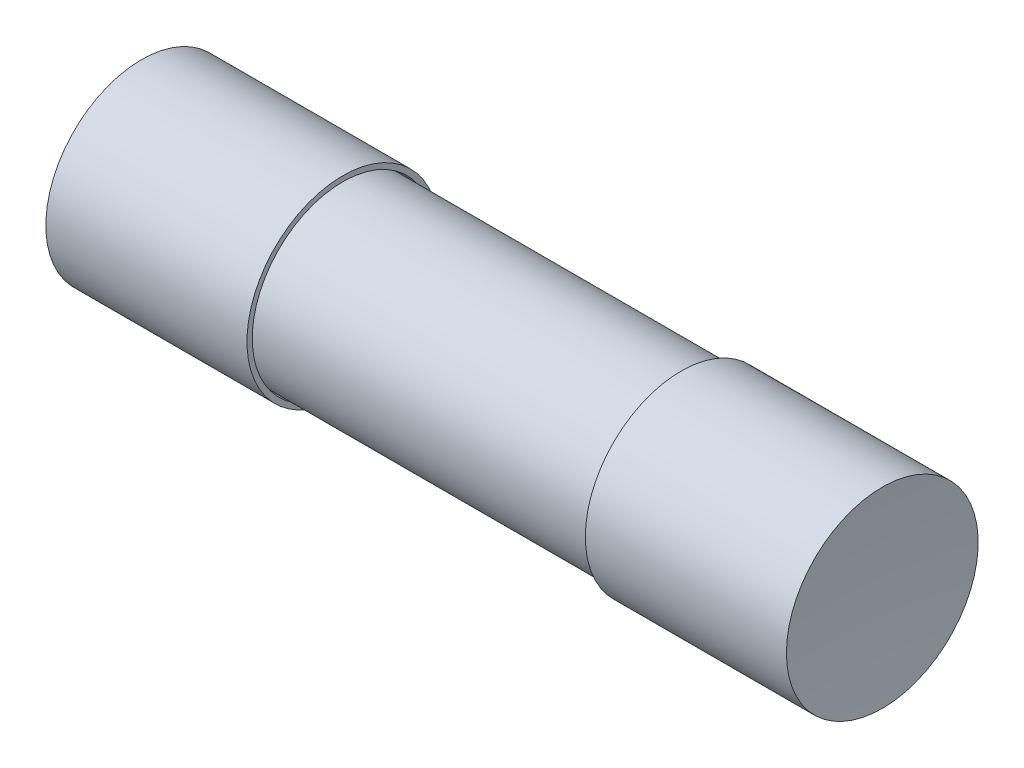
ISO-10303-21;
HEADER;
FILE_DESCRIPTION(('STEP AP214'),'2;1');
FILE_NAME('part.step','',(''),(''),'','','');
FILE_SCHEMA(('AUTOMOTIVE_DESIGN { 1 0 10303 214 1 1 1 1 }'));
ENDSEC;
DATA;
#1=APPLICATION_CONTEXT('core data for automotive mechanical design processes');
#2=APPLICATION_PROTOCOL_DEFINITION('international standard','automotive_design',2000,#1);
#3=PRODUCT_CONTEXT('',#1,'mechanical');
#4=PRODUCT('Part','Part','',(#3));
#5=PRODUCT_RELATED_PRODUCT_CATEGORY('part','',(#4));
#6=PRODUCT_DEFINITION_FORMATION('','',#4);
#7=PRODUCT_DEFINITION_CONTEXT('part definition',#1,'design');
#8=PRODUCT_DEFINITION('design','',#6,#7);
#9=PRODUCT_DEFINITION_SHAPE('','',#8);
#10=(LENGTH_UNIT() NAMED_UNIT(*) SI_UNIT(.MILLI.,.METRE.));
#11=(NAMED_UNIT(*) PLANE_ANGLE_UNIT() SI_UNIT($,.RADIAN.));
#12=(NAMED_UNIT(*) SI_UNIT($,.STERADIAN.) SOLID_ANGLE_UNIT());
#13=UNCERTAINTY_MEASURE_WITH_UNIT(LENGTH_MEASURE(1.E-05),#10,'distance_accuracy_value','');
#14=(GEOMETRIC_REPRESENTATION_CONTEXT(3) GLOBAL_UNCERTAINTY_ASSIGNED_CONTEXT((#13)) GLOBAL_UNIT_ASSIGNED_CONTEXT((#10,
#11,#12)) REPRESENTATION_CONTEXT('',''));
#15=CARTESIAN_POINT('',(0.,0.,0.));
#16=DIRECTION('',(0.,0.,1.));
#17=DIRECTION('',(1.,0.,0.));
#18=AXIS2_PLACEMENT_3D('',#15,#16,#17);
#19=CARTESIAN_POINT('',(-9.75,0.,0.));
#20=DIRECTION('',(1.,0.,0.));
#21=DIRECTION('',(0.,0.,-1.));
#22=AXIS2_PLACEMENT_3D('',#19,#20,#21);
#23=CYLINDRICAL_SURFACE('',#22,2.375);
#24=CARTESIAN_POINT('',(-9.75,0.,0.));
#25=DIRECTION('',(1.,0.,0.));
#26=DIRECTION('',(0.,0.,-1.));
#27=AXIS2_PLACEMENT_3D('',#24,#25,#26);
#28=CIRCLE('',#27,2.375);
#29=CARTESIAN_POINT('',(-9.75,0.,-2.375));
#30=VERTEX_POINT('',#29);
#31=EDGE_CURVE('P0_E18',#30,#30,#28,.T.);
#32=ORIENTED_EDGE('',*,*,#31,.T.);
#33=EDGE_LOOP('',(#32));
#34=FACE_BOUND('',#33,.T.);
#35=CARTESIAN_POINT('',(9.75,0.,0.));
#36=DIRECTION('',(1.,0.,0.));
#37=DIRECTION('',(0.,0.,-1.));
#38=AXIS2_PLACEMENT_3D('',#35,#36,#37);
#39=CIRCLE('',#38,2.375);
#40=CARTESIAN_POINT('',(9.75,0.,-2.375));
#41=VERTEX_POINT('',#40);
#42=EDGE_CURVE('P0_E27',#41,#41,#39,.T.);
#43=ORIENTED_EDGE('',*,*,#42,.F.);
#44=EDGE_LOOP('',(#43));
#45=FACE_BOUND('',#44,.T.);
#46=ADVANCED_FACE('P0_F14',(#34,#45),#23,.T.);
#47=CARTESIAN_POINT('',(-9.75,-2.4035,2.4035));
#48=DIRECTION('',(1.,0.,0.));
#49=DIRECTION('',(0.,0.,-1.));
#50=AXIS2_PLACEMENT_3D('',#47,#48,#49);
#51=PLANE('',#50);
#52=CARTESIAN_POINT('',(-9.75,0.,0.));
#53=DIRECTION('',(1.,0.,0.));
#54=DIRECTION('',(0.,0.,-1.));
#55=AXIS2_PLACEMENT_3D('',#52,#53,#54);
#56=CIRCLE('',#55,2.175);
#57=CARTESIAN_POINT('',(-9.75,0.,-2.175));
#58=VERTEX_POINT('',#57);
#59=EDGE_CURVE('P0_E22',#58,#58,#56,.F.);
#60=ORIENTED_EDGE('',*,*,#59,.F.);
#61=EDGE_LOOP('',(#60));
#62=FACE_BOUND('',#61,.T.);
#63=ORIENTED_EDGE('',*,*,#31,.F.);
#64=EDGE_LOOP('',(#63));
#65=FACE_BOUND('',#64,.T.);
#66=ADVANCED_FACE('P0_F37',(#62,#65),#51,.F.);
#67=CARTESIAN_POINT('',(9.75,-2.4035,2.4035));
#68=DIRECTION('',(1.,0.,0.));
#69=DIRECTION('',(0.,0.,-1.));
#70=AXIS2_PLACEMENT_3D('',#67,#68,#69);
#71=PLANE('',#70);
#72=CARTESIAN_POINT('',(9.75,0.,0.));
#73=DIRECTION('',(1.,0.,0.));
#74=DIRECTION('',(0.,0.,-1.));
#75=AXIS2_PLACEMENT_3D('',#72,#73,#74);
#76=CIRCLE('',#75,2.175);
#77=CARTESIAN_POINT('',(9.75,0.,-2.175));
#78=VERTEX_POINT('',#77);
#79=EDGE_CURVE('P0_E10',#78,#78,#76,.T.);
#80=ORIENTED_EDGE('',*,*,#79,.F.);
#81=EDGE_LOOP('',(#80));
#82=FACE_BOUND('',#81,.T.);
#83=ORIENTED_EDGE('',*,*,#42,.T.);
#84=EDGE_LOOP('',(#83));
#85=FACE_BOUND('',#84,.T.);
#86=ADVANCED_FACE('P0_F16',(#82,#85),#71,.T.);
#87=CARTESIAN_POINT('',(-9.75,0.,0.));
#88=DIRECTION('',(1.,0.,0.));
#89=DIRECTION('',(0.,0.,-1.));
#90=AXIS2_PLACEMENT_3D('',#87,#88,#89);
#91=CYLINDRICAL_SURFACE('',#90,2.175);
#92=ORIENTED_EDGE('',*,*,#79,.T.);
#93=EDGE_LOOP('',(#92));
#94=FACE_BOUND('',#93,.T.);
#95=ORIENTED_EDGE('',*,*,#59,.T.);
#96=EDGE_LOOP('',(#95));
#97=FACE_BOUND('',#96,.T.);
#98=ADVANCED_FACE('P0_F45',(#94,#97),#91,.F.);
#99=CLOSED_SHELL('',(#46,#66,#86,#98));
#100=MANIFOLD_SOLID_BREP('P0_B1',#99);
#101=CARTESIAN_POINT('',(9.65,-0.0506,0.0506));
#102=DIRECTION('',(1.,0.,0.));
#103=DIRECTION('',(0.,0.,-1.));
#104=AXIS2_PLACEMENT_3D('',#101,#102,#103);
#105=PLANE('',#104);
#106=CARTESIAN_POINT('',(9.65,0.,0.));
#107=DIRECTION('',(1.,0.,0.));
#108=DIRECTION('',(0.,0.,-1.));
#109=AXIS2_PLACEMENT_3D('',#106,#107,#108);
#110=CIRCLE('',#109,0.05);
#111=CARTESIAN_POINT('',(9.65,0.,-0.05));
#112=VERTEX_POINT('',#111);
#113=EDGE_CURVE('P1_E18',#112,#112,#110,.T.);
#114=ORIENTED_EDGE('',*,*,#113,.T.);
#115=EDGE_LOOP('',(#114));
#116=FACE_BOUND('',#115,.T.);
#117=ADVANCED_FACE('P1_F14',(#116),#105,.T.);
#118=CARTESIAN_POINT('',(-9.65,-0.0506,0.0506));
#119=DIRECTION('',(1.,0.,0.));
#120=DIRECTION('',(0.,0.,-1.));
#121=AXIS2_PLACEMENT_3D('',#118,#119,#120);
#122=PLANE('',#121);
#123=CARTESIAN_POINT('',(-9.65,0.,0.));
#124=DIRECTION('',(1.,0.,0.));
#125=DIRECTION('',(0.,0.,-1.));
#126=AXIS2_PLACEMENT_3D('',#123,#124,#125);
#127=CIRCLE('',#126,0.05);
#128=CARTESIAN_POINT('',(-9.65,0.,-0.05));
#129=VERTEX_POINT('',#128);
#130=EDGE_CURVE('P1_E10',#129,#129,#127,.F.);
#131=ORIENTED_EDGE('',*,*,#130,.T.);
#132=EDGE_LOOP('',(#131));
#133=FACE_BOUND('',#132,.T.);
#134=ADVANCED_FACE('P1_F16',(#133),#122,.F.);
#135=CARTESIAN_POINT('',(-9.65,0.,0.));
#136=DIRECTION('',(1.,0.,0.));
#137=DIRECTION('',(0.,0.,-1.));
#138=AXIS2_PLACEMENT_3D('',#135,#136,#137);
#139=CYLINDRICAL_SURFACE('',#138,0.05);
#140=ORIENTED_EDGE('',*,*,#113,.F.);
#141=EDGE_LOOP('',(#140));
#142=FACE_BOUND('',#141,.T.);
#143=ORIENTED_EDGE('',*,*,#130,.F.);
#144=EDGE_LOOP('',(#143));
#145=FACE_BOUND('',#144,.T.);
#146=ADVANCED_FACE('P1_F28',(#142,#145),#139,.T.);
#147=CLOSED_SHELL('',(#117,#134,#146));
#148=MANIFOLD_SOLID_BREP('P1_B1',#147);
#149=CARTESIAN_POINT('',(42.3125000000002,0.,1.98951966012828E-13));
#150=DIRECTION('',(0.,0.,1.));
#151=DIRECTION('',(-1.,0.,0.));
#152=AXIS2_PLACEMENT_3D('',#149,#150,#151);
#153=SPHERICAL_SURFACE('',#152,32.5625);
#154=CARTESIAN_POINT('',(9.85,0.,0.));
#155=DIRECTION('',(-1.,0.,0.));
#156=DIRECTION('',(0.,0.,1.));
#157=AXIS2_PLACEMENT_3D('',#154,#155,#156);
#158=CIRCLE('',#157,2.55);
#159=CARTESIAN_POINT('',(9.85,0.,2.55));
#160=VERTEX_POINT('',#159);
#161=EDGE_CURVE('P2_E18',#160,#160,#158,.F.);
#162=ORIENTED_EDGE('',*,*,#161,.T.);
#163=EDGE_LOOP('',(#162));
#164=FACE_BOUND('',#163,.T.);
#165=ADVANCED_FACE('P2_F14',(#164),#153,.F.);
#166=CARTESIAN_POINT('',(9.85,0.,0.));
#167=DIRECTION('',(-1.,0.,0.));
#168=DIRECTION('',(0.,0.,1.));
#169=AXIS2_PLACEMENT_3D('',#166,#167,#168);
#170=CYLINDRICAL_SURFACE('',#169,2.55);
#171=ORIENTED_EDGE('',*,*,#161,.F.);
#172=EDGE_LOOP('',(#171));
#173=FACE_BOUND('',#172,.T.);
#174=CARTESIAN_POINT('',(4.5,0.,0.));
#175=DIRECTION('',(-1.,0.,0.));
#176=DIRECTION('',(0.,0.,1.));
#177=AXIS2_PLACEMENT_3D('',#174,#175,#176);
#178=CIRCLE('',#177,2.55);
#179=CARTESIAN_POINT('',(4.5,0.,2.55));
#180=VERTEX_POINT('',#179);
#181=EDGE_CURVE('P2_E27',#180,#180,#178,.F.);
#182=ORIENTED_EDGE('',*,*,#181,.T.);
#183=EDGE_LOOP('',(#182));
#184=FACE_BOUND('',#183,.T.);
#185=ADVANCED_FACE('P2_F38',(#173,#184),#170,.T.);
#186=CARTESIAN_POINT('',(9.71,-2.43892,2.43892));
#187=DIRECTION('',(1.,0.,0.));
#188=DIRECTION('',(0.,0.,-1.));
#189=AXIS2_PLACEMENT_3D('',#186,#187,#188);
#190=PLANE('',#189);
#191=CARTESIAN_POINT('',(9.71,0.,0.));
#192=DIRECTION('',(-1.,0.,0.));
#193=DIRECTION('',(0.,0.,1.));
#194=AXIS2_PLACEMENT_3D('',#191,#192,#193);
#195=CIRCLE('',#194,2.41);
#196=CARTESIAN_POINT('',(9.71,0.,2.41));
#197=VERTEX_POINT('',#196);
#198=EDGE_CURVE('P2_E22',#197,#197,#195,.F.);
#199=ORIENTED_EDGE('',*,*,#198,.F.);
#200=EDGE_LOOP('',(#199));
#201=FACE_BOUND('',#200,.T.);
#202=ADVANCED_FACE('P2_F40',(#201),#190,.F.);
#203=CARTESIAN_POINT('',(4.5,-2.5806,2.5806));
#204=DIRECTION('',(1.,0.,0.));
#205=DIRECTION('',(0.,0.,-1.));
#206=AXIS2_PLACEMENT_3D('',#203,#204,#205);
#207=PLANE('',#206);
#208=CARTESIAN_POINT('',(4.5,0.,0.));
#209=DIRECTION('',(-1.,0.,0.));
#210=DIRECTION('',(0.,0.,1.));
#211=AXIS2_PLACEMENT_3D('',#208,#209,#210);
#212=CIRCLE('',#211,2.41);
#213=CARTESIAN_POINT('',(4.5,0.,2.41));
#214=VERTEX_POINT('',#213);
#215=EDGE_CURVE('P2_E10',#214,#214,#212,.T.);
#216=ORIENTED_EDGE('',*,*,#215,.F.);
#217=EDGE_LOOP('',(#216));
#218=FACE_BOUND('',#217,.T.);
#219=ORIENTED_EDGE('',*,*,#181,.F.);
#220=EDGE_LOOP('',(#219));
#221=FACE_BOUND('',#220,.T.);
#222=ADVANCED_FACE('P2_F16',(#218,#221),#207,.F.);
#223=CARTESIAN_POINT('',(9.71,0.,0.));
#224=DIRECTION('',(-1.,0.,0.));
#225=DIRECTION('',(0.,0.,1.));
#226=AXIS2_PLACEMENT_3D('',#223,#224,#225);
#227=CYLINDRICAL_SURFACE('',#226,2.41);
#228=ORIENTED_EDGE('',*,*,#215,.T.);
#229=EDGE_LOOP('',(#228));
#230=FACE_BOUND('',#229,.T.);
#231=ORIENTED_EDGE('',*,*,#198,.T.);
#232=EDGE_LOOP('',(#231));
#233=FACE_BOUND('',#232,.T.);
#234=ADVANCED_FACE('P2_F50',(#230,#233),#227,.F.);
#235=CLOSED_SHELL('',(#165,#185,#202,#222,#234));
#236=MANIFOLD_SOLID_BREP('P2_B1',#235);
#237=CARTESIAN_POINT('',(-42.3125000000002,0.,-1.98951966012828E-13));
#238=DIRECTION('',(0.,0.,1.));
#239=DIRECTION('',(-1.,0.,0.));
#240=AXIS2_PLACEMENT_3D('',#237,#238,#239);
#241=SPHERICAL_SURFACE('',#240,32.5625);
#242=CARTESIAN_POINT('',(-9.85,0.,0.));
#243=DIRECTION('',(1.,0.,0.));
#244=DIRECTION('',(0.,0.,-1.));
#245=AXIS2_PLACEMENT_3D('',#242,#243,#244);
#246=CIRCLE('',#245,2.55);
#247=CARTESIAN_POINT('',(-9.85,0.,-2.55));
#248=VERTEX_POINT('',#247);
#249=EDGE_CURVE('P3_E17',#248,#248,#246,.F.);
#250=ORIENTED_EDGE('',*,*,#249,.T.);
#251=EDGE_LOOP('',(#250));
#252=FACE_BOUND('',#251,.T.);
#253=ADVANCED_FACE('P3_F13',(#252),#241,.F.);
#254=CARTESIAN_POINT('',(-9.85,0.,0.));
#255=DIRECTION('',(1.,0.,0.));
#256=DIRECTION('',(0.,0.,-1.));
#257=AXIS2_PLACEMENT_3D('',#254,#255,#256);
#258=CYLINDRICAL_SURFACE('',#257,2.55);
#259=ORIENTED_EDGE('',*,*,#249,.F.);
#260=EDGE_LOOP('',(#259));
#261=FACE_BOUND('',#260,.T.);
#262=CARTESIAN_POINT('',(-4.5,0.,0.));
#263=DIRECTION('',(1.,0.,0.));
#264=DIRECTION('',(0.,0.,-1.));
#265=AXIS2_PLACEMENT_3D('',#262,#263,#264);
#266=CIRCLE('',#265,2.55);
#267=CARTESIAN_POINT('',(-4.5,0.,-2.55));
#268=VERTEX_POINT('',#267);
#269=EDGE_CURVE('P3_E26',#268,#268,#266,.F.);
#270=ORIENTED_EDGE('',*,*,#269,.T.);
#271=EDGE_LOOP('',(#270));
#272=FACE_BOUND('',#271,.T.);
#273=ADVANCED_FACE('P3_F37',(#261,#272),#258,.T.);
#274=CARTESIAN_POINT('',(-9.71,-2.43892,-2.43892));
#275=DIRECTION('',(-1.,0.,0.));
#276=DIRECTION('',(0.,0.,1.));
#277=AXIS2_PLACEMENT_3D('',#274,#275,#276);
#278=PLANE('',#277);
#279=CARTESIAN_POINT('',(-9.71,0.,0.));
#280=DIRECTION('',(1.,0.,0.));
#281=DIRECTION('',(0.,0.,-1.));
#282=AXIS2_PLACEMENT_3D('',#279,#280,#281);
#283=CIRCLE('',#282,2.41);
#284=CARTESIAN_POINT('',(-9.71,0.,-2.41));
#285=VERTEX_POINT('',#284);
#286=EDGE_CURVE('P3_E21',#285,#285,#283,.F.);
#287=ORIENTED_EDGE('',*,*,#286,.F.);
#288=EDGE_LOOP('',(#287));
#289=FACE_BOUND('',#288,.T.);
#290=ADVANCED_FACE('P3_F39',(#289),#278,.F.);
#291=CARTESIAN_POINT('',(-4.5,-2.5806,-2.5806));
#292=DIRECTION('',(-1.,0.,0.));
#293=DIRECTION('',(0.,0.,1.));
#294=AXIS2_PLACEMENT_3D('',#291,#292,#293);
#295=PLANE('',#294);
#296=CARTESIAN_POINT('',(-4.5,0.,0.));
#297=DIRECTION('',(1.,0.,0.));
#298=DIRECTION('',(0.,0.,-1.));
#299=AXIS2_PLACEMENT_3D('',#296,#297,#298);
#300=CIRCLE('',#299,2.41);
#301=CARTESIAN_POINT('',(-4.5,0.,-2.41));
#302=VERTEX_POINT('',#301);
#303=EDGE_CURVE('P3_E9',#302,#302,#300,.T.);
#304=ORIENTED_EDGE('',*,*,#303,.F.);
#305=EDGE_LOOP('',(#304));
#306=FACE_BOUND('',#305,.T.);
#307=ORIENTED_EDGE('',*,*,#269,.F.);
#308=EDGE_LOOP('',(#307));
#309=FACE_BOUND('',#308,.T.);
#310=ADVANCED_FACE('P3_F15',(#306,#309),#295,.F.);
#311=CARTESIAN_POINT('',(-9.71,0.,0.));
#312=DIRECTION('',(1.,0.,0.));
#313=DIRECTION('',(0.,0.,-1.));
#314=AXIS2_PLACEMENT_3D('',#311,#312,#313);
#315=CYLINDRICAL_SURFACE('',#314,2.41);
#316=ORIENTED_EDGE('',*,*,#303,.T.);
#317=EDGE_LOOP('',(#316));
#318=FACE_BOUND('',#317,.T.);
#319=ORIENTED_EDGE('',*,*,#286,.T.);
#320=EDGE_LOOP('',(#319));
#321=FACE_BOUND('',#320,.T.);
#322=ADVANCED_FACE('P3_F49',(#318,#321),#315,.F.);
#323=CLOSED_SHELL('',(#253,#273,#290,#310,#322));
#324=MANIFOLD_SOLID_BREP('P3_B1',#323);
#325=ADVANCED_BREP_SHAPE_REPRESENTATION('',(#18,#100,#148,#236,#324),#14);
#326=SHAPE_DEFINITION_REPRESENTATION(#9,#325);
ENDSEC;
END-ISO-10303-21;
